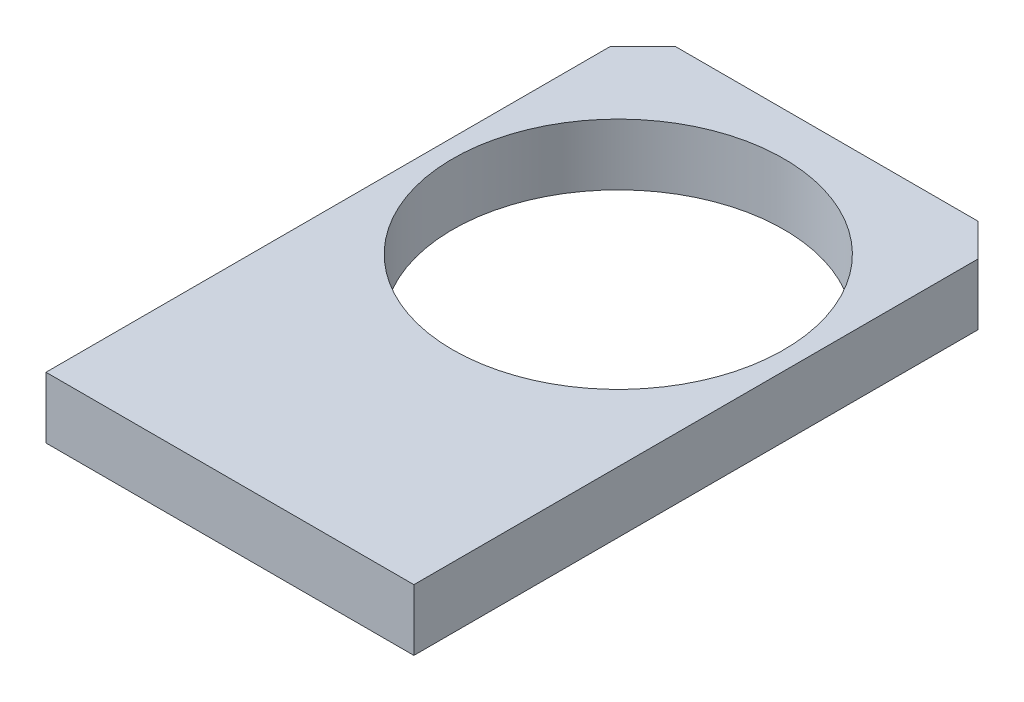
ISO-10303-21;
HEADER;
FILE_DESCRIPTION(('STEP AP214'),'2;1');
FILE_NAME('part.step','',(''),(''),'','','');
FILE_SCHEMA(('AUTOMOTIVE_DESIGN { 1 0 10303 214 1 1 1 1 }'));
ENDSEC;
DATA;
#1=APPLICATION_CONTEXT('core data for automotive mechanical design processes');
#2=APPLICATION_PROTOCOL_DEFINITION('international standard','automotive_design',2000,#1);
#3=PRODUCT_CONTEXT('',#1,'mechanical');
#4=PRODUCT('Part','Part','',(#3));
#5=PRODUCT_RELATED_PRODUCT_CATEGORY('part','',(#4));
#6=PRODUCT_DEFINITION_FORMATION('','',#4);
#7=PRODUCT_DEFINITION_CONTEXT('part definition',#1,'design');
#8=PRODUCT_DEFINITION('design','',#6,#7);
#9=PRODUCT_DEFINITION_SHAPE('','',#8);
#10=(LENGTH_UNIT() NAMED_UNIT(*) SI_UNIT(.MILLI.,.METRE.));
#11=(NAMED_UNIT(*) PLANE_ANGLE_UNIT() SI_UNIT($,.RADIAN.));
#12=(NAMED_UNIT(*) SI_UNIT($,.STERADIAN.) SOLID_ANGLE_UNIT());
#13=UNCERTAINTY_MEASURE_WITH_UNIT(LENGTH_MEASURE(1.E-05),#10,'distance_accuracy_value','');
#14=(GEOMETRIC_REPRESENTATION_CONTEXT(3) GLOBAL_UNCERTAINTY_ASSIGNED_CONTEXT((#13)) GLOBAL_UNIT_ASSIGNED_CONTEXT((#10,
#11,#12)) REPRESENTATION_CONTEXT('',''));
#15=CARTESIAN_POINT('',(0.,0.,0.));
#16=DIRECTION('',(0.,0.,1.));
#17=DIRECTION('',(1.,0.,0.));
#18=AXIS2_PLACEMENT_3D('',#15,#16,#17);
#19=CARTESIAN_POINT('',(0.,7.5,0.));
#20=DIRECTION('',(0.,-1.,0.));
#21=DIRECTION('',(0.,0.,-1.));
#22=AXIS2_PLACEMENT_3D('',#19,#20,#21);
#23=PLANE('',#22);
#24=DIRECTION('',(-1.,0.,0.));
#25=VECTOR('',#24,1.);
#26=CARTESIAN_POINT('',(-22.5,7.5,-73.));
#27=LINE('',#26,#25);
#28=CARTESIAN_POINT('',(18.5,7.5,-73.));
#29=VERTEX_POINT('',#28);
#30=CARTESIAN_POINT('',(-18.5,7.5,-73.));
#31=VERTEX_POINT('',#30);
#32=EDGE_CURVE('E129',#29,#31,#27,.T.);
#33=ORIENTED_EDGE('',*,*,#32,.T.);
#34=DIRECTION('',(0.707106781186549,0.,-0.707106781186546));
#35=VECTOR('',#34,1.);
#36=CARTESIAN_POINT('',(-22.5,7.5,-69.));
#37=LINE('',#36,#35);
#38=CARTESIAN_POINT('',(-22.5,7.5,-69.));
#39=VERTEX_POINT('',#38);
#40=EDGE_CURVE('E50',#31,#39,#37,.F.);
#41=ORIENTED_EDGE('',*,*,#40,.T.);
#42=DIRECTION('',(0.,0.,1.));
#43=VECTOR('',#42,1.);
#44=CARTESIAN_POINT('',(-22.5,7.5,0.));
#45=LINE('',#44,#43);
#46=CARTESIAN_POINT('',(-22.5,7.5,0.));
#47=VERTEX_POINT('',#46);
#48=EDGE_CURVE('E96',#39,#47,#45,.T.);
#49=ORIENTED_EDGE('',*,*,#48,.T.);
#50=DIRECTION('',(1.,0.,0.));
#51=VECTOR('',#50,1.);
#52=CARTESIAN_POINT('',(-22.5,7.5,0.));
#53=LINE('',#52,#51);
#54=CARTESIAN_POINT('',(22.5,7.5,0.));
#55=VERTEX_POINT('',#54);
#56=EDGE_CURVE('E99',#47,#55,#53,.T.);
#57=ORIENTED_EDGE('',*,*,#56,.T.);
#58=DIRECTION('',(0.,0.,-1.));
#59=VECTOR('',#58,1.);
#60=CARTESIAN_POINT('',(22.5,7.5,0.));
#61=LINE('',#60,#59);
#62=CARTESIAN_POINT('',(22.5,7.5,-69.));
#63=VERTEX_POINT('',#62);
#64=EDGE_CURVE('E116',#55,#63,#61,.T.);
#65=ORIENTED_EDGE('',*,*,#64,.T.);
#66=DIRECTION('',(0.707106781186548,0.,0.707106781186548));
#67=VECTOR('',#66,1.);
#68=CARTESIAN_POINT('',(18.5,7.5,-73.));
#69=LINE('',#68,#67);
#70=EDGE_CURVE('E144',#63,#29,#69,.F.);
#71=ORIENTED_EDGE('',*,*,#70,.T.);
#72=EDGE_LOOP('',(#33,#41,#49,#57,#65,#71));
#73=FACE_BOUND('',#72,.T.);
#74=CARTESIAN_POINT('',(0.,7.5,-47.5));
#75=DIRECTION('',(0.,1.,0.));
#76=DIRECTION('',(0.,0.,1.));
#77=AXIS2_PLACEMENT_3D('',#74,#75,#76);
#78=CIRCLE('',#77,20.25);
#79=CARTESIAN_POINT('',(0.,7.5,-27.25));
#80=VERTEX_POINT('',#79);
#81=EDGE_CURVE('E168',#80,#80,#78,.T.);
#82=ORIENTED_EDGE('',*,*,#81,.F.);
#83=EDGE_LOOP('',(#82));
#84=FACE_BOUND('',#83,.T.);
#85=ADVANCED_FACE('F41',(#73,#84),#23,.F.);
#86=CARTESIAN_POINT('',(0.,0.,0.));
#87=DIRECTION('',(0.,-1.,0.));
#88=DIRECTION('',(0.,0.,-1.));
#89=AXIS2_PLACEMENT_3D('',#86,#87,#88);
#90=PLANE('',#89);
#91=DIRECTION('',(0.,0.,1.));
#92=VECTOR('',#91,1.);
#93=CARTESIAN_POINT('',(-22.5,0.,0.));
#94=LINE('',#93,#92);
#95=CARTESIAN_POINT('',(-22.5,0.,-69.));
#96=VERTEX_POINT('',#95);
#97=CARTESIAN_POINT('',(-22.5,0.,0.));
#98=VERTEX_POINT('',#97);
#99=EDGE_CURVE('E120',#96,#98,#94,.T.);
#100=ORIENTED_EDGE('',*,*,#99,.F.);
#101=DIRECTION('',(-0.707106781186549,0.,0.707106781186546));
#102=VECTOR('',#101,1.);
#103=CARTESIAN_POINT('',(-45.75,0.,-45.7500000000001));
#104=LINE('',#103,#102);
#105=CARTESIAN_POINT('',(-18.5,0.,-73.));
#106=VERTEX_POINT('',#105);
#107=EDGE_CURVE('E135',#96,#106,#104,.F.);
#108=ORIENTED_EDGE('',*,*,#107,.T.);
#109=DIRECTION('',(-1.,0.,0.));
#110=VECTOR('',#109,1.);
#111=CARTESIAN_POINT('',(-22.5,0.,-73.));
#112=LINE('',#111,#110);
#113=CARTESIAN_POINT('',(18.5,0.,-73.));
#114=VERTEX_POINT('',#113);
#115=EDGE_CURVE('E107',#114,#106,#112,.T.);
#116=ORIENTED_EDGE('',*,*,#115,.F.);
#117=DIRECTION('',(-0.707106781186548,0.,-0.707106781186548));
#118=VECTOR('',#117,1.);
#119=CARTESIAN_POINT('',(45.75,0.,-45.75));
#120=LINE('',#119,#118);
#121=CARTESIAN_POINT('',(22.5,0.,-69.));
#122=VERTEX_POINT('',#121);
#123=EDGE_CURVE('E127',#114,#122,#120,.F.);
#124=ORIENTED_EDGE('',*,*,#123,.T.);
#125=DIRECTION('',(0.,0.,-1.));
#126=VECTOR('',#125,1.);
#127=CARTESIAN_POINT('',(22.5,0.,0.));
#128=LINE('',#127,#126);
#129=CARTESIAN_POINT('',(22.5,0.,0.));
#130=VERTEX_POINT('',#129);
#131=EDGE_CURVE('E158',#130,#122,#128,.T.);
#132=ORIENTED_EDGE('',*,*,#131,.F.);
#133=DIRECTION('',(1.,0.,0.));
#134=VECTOR('',#133,1.);
#135=CARTESIAN_POINT('',(-22.5,0.,0.));
#136=LINE('',#135,#134);
#137=EDGE_CURVE('E161',#98,#130,#136,.T.);
#138=ORIENTED_EDGE('',*,*,#137,.F.);
#139=EDGE_LOOP('',(#100,#108,#116,#124,#132,#138));
#140=FACE_BOUND('',#139,.T.);
#141=CARTESIAN_POINT('',(0.,0.,-47.5));
#142=DIRECTION('',(0.,1.,0.));
#143=DIRECTION('',(0.,0.,1.));
#144=AXIS2_PLACEMENT_3D('',#141,#142,#143);
#145=CIRCLE('',#144,20.25);
#146=CARTESIAN_POINT('',(0.,0.,-27.25));
#147=VERTEX_POINT('',#146);
#148=EDGE_CURVE('E172',#147,#147,#145,.T.);
#149=ORIENTED_EDGE('',*,*,#148,.T.);
#150=EDGE_LOOP('',(#149));
#151=FACE_BOUND('',#150,.T.);
#152=ADVANCED_FACE('F156',(#140,#151),#90,.T.);
#153=CARTESIAN_POINT('',(-22.5,7.5,0.));
#154=DIRECTION('',(1.,0.,0.));
#155=DIRECTION('',(0.,0.,-1.));
#156=AXIS2_PLACEMENT_3D('',#153,#154,#155);
#157=PLANE('',#156);
#158=ORIENTED_EDGE('',*,*,#48,.F.);
#159=DIRECTION('',(0.,-1.,0.));
#160=VECTOR('',#159,1.);
#161=CARTESIAN_POINT('',(-22.5,7.5,-69.));
#162=LINE('',#161,#160);
#163=EDGE_CURVE('E123',#39,#96,#162,.T.);
#164=ORIENTED_EDGE('',*,*,#163,.T.);
#165=ORIENTED_EDGE('',*,*,#99,.T.);
#166=DIRECTION('',(0.,-1.,0.));
#167=VECTOR('',#166,1.);
#168=CARTESIAN_POINT('',(-22.5,7.5,0.));
#169=LINE('',#168,#167);
#170=EDGE_CURVE('E112',#47,#98,#169,.T.);
#171=ORIENTED_EDGE('',*,*,#170,.F.);
#172=EDGE_LOOP('',(#158,#164,#165,#171));
#173=FACE_BOUND('',#172,.T.);
#174=ADVANCED_FACE('F118',(#173),#157,.F.);
#175=CARTESIAN_POINT('',(-22.5,7.5,0.));
#176=DIRECTION('',(0.,0.,-1.));
#177=DIRECTION('',(-1.,0.,0.));
#178=AXIS2_PLACEMENT_3D('',#175,#176,#177);
#179=PLANE('',#178);
#180=ORIENTED_EDGE('',*,*,#137,.T.);
#181=DIRECTION('',(0.,-1.,0.));
#182=VECTOR('',#181,1.);
#183=CARTESIAN_POINT('',(22.5,7.5,0.));
#184=LINE('',#183,#182);
#185=EDGE_CURVE('E114',#55,#130,#184,.T.);
#186=ORIENTED_EDGE('',*,*,#185,.F.);
#187=ORIENTED_EDGE('',*,*,#56,.F.);
#188=ORIENTED_EDGE('',*,*,#170,.T.);
#189=EDGE_LOOP('',(#180,#186,#187,#188));
#190=FACE_BOUND('',#189,.T.);
#191=ADVANCED_FACE('F111',(#190),#179,.F.);
#192=CARTESIAN_POINT('',(22.5,7.5,0.));
#193=DIRECTION('',(-1.,0.,0.));
#194=DIRECTION('',(0.,0.,1.));
#195=AXIS2_PLACEMENT_3D('',#192,#193,#194);
#196=PLANE('',#195);
#197=ORIENTED_EDGE('',*,*,#131,.T.);
#198=DIRECTION('',(0.,1.,0.));
#199=VECTOR('',#198,1.);
#200=CARTESIAN_POINT('',(22.5,7.5,-69.));
#201=LINE('',#200,#199);
#202=EDGE_CURVE('E11',#122,#63,#201,.T.);
#203=ORIENTED_EDGE('',*,*,#202,.T.);
#204=ORIENTED_EDGE('',*,*,#64,.F.);
#205=ORIENTED_EDGE('',*,*,#185,.T.);
#206=EDGE_LOOP('',(#197,#203,#204,#205));
#207=FACE_BOUND('',#206,.T.);
#208=ADVANCED_FACE('F159',(#207),#196,.F.);
#209=CARTESIAN_POINT('',(-22.5,7.5,-73.));
#210=DIRECTION('',(0.,0.,1.));
#211=DIRECTION('',(1.,0.,0.));
#212=AXIS2_PLACEMENT_3D('',#209,#210,#211);
#213=PLANE('',#212);
#214=ORIENTED_EDGE('',*,*,#115,.T.);
#215=DIRECTION('',(0.,1.,0.));
#216=VECTOR('',#215,1.);
#217=CARTESIAN_POINT('',(-18.5,7.5,-73.));
#218=LINE('',#217,#216);
#219=EDGE_CURVE('E63',#106,#31,#218,.T.);
#220=ORIENTED_EDGE('',*,*,#219,.T.);
#221=ORIENTED_EDGE('',*,*,#32,.F.);
#222=DIRECTION('',(0.,-1.,0.));
#223=VECTOR('',#222,1.);
#224=CARTESIAN_POINT('',(18.5,7.5,-73.));
#225=LINE('',#224,#223);
#226=EDGE_CURVE('E138',#29,#114,#225,.T.);
#227=ORIENTED_EDGE('',*,*,#226,.T.);
#228=EDGE_LOOP('',(#214,#220,#221,#227));
#229=FACE_BOUND('',#228,.T.);
#230=ADVANCED_FACE('F150',(#229),#213,.F.);
#231=CARTESIAN_POINT('',(0.,7.5,-47.5));
#232=DIRECTION('',(0.,-1.,0.));
#233=DIRECTION('',(0.,0.,-1.));
#234=AXIS2_PLACEMENT_3D('',#231,#232,#233);
#235=CYLINDRICAL_SURFACE('',#234,20.25);
#236=ORIENTED_EDGE('',*,*,#81,.T.);
#237=EDGE_LOOP('',(#236));
#238=FACE_BOUND('',#237,.T.);
#239=ORIENTED_EDGE('',*,*,#148,.F.);
#240=EDGE_LOOP('',(#239));
#241=FACE_BOUND('',#240,.T.);
#242=ADVANCED_FACE('F180',(#238,#241),#235,.F.);
#243=CARTESIAN_POINT('',(-22.5,7.5,-69.));
#244=DIRECTION('',(0.707106781186546,0.,0.707106781186549));
#245=DIRECTION('',(0.,-1.,0.));
#246=AXIS2_PLACEMENT_3D('',#243,#244,#245);
#247=PLANE('',#246);
#248=ORIENTED_EDGE('',*,*,#40,.F.);
#249=ORIENTED_EDGE('',*,*,#219,.F.);
#250=ORIENTED_EDGE('',*,*,#107,.F.);
#251=ORIENTED_EDGE('',*,*,#163,.F.);
#252=EDGE_LOOP('',(#248,#249,#250,#251));
#253=FACE_BOUND('',#252,.T.);
#254=ADVANCED_FACE('F197',(#253),#247,.F.);
#255=CARTESIAN_POINT('',(18.5,7.5,-73.));
#256=DIRECTION('',(-0.707106781186548,0.,0.707106781186548));
#257=DIRECTION('',(0.,-1.,0.));
#258=AXIS2_PLACEMENT_3D('',#255,#256,#257);
#259=PLANE('',#258);
#260=ORIENTED_EDGE('',*,*,#70,.F.);
#261=ORIENTED_EDGE('',*,*,#202,.F.);
#262=ORIENTED_EDGE('',*,*,#123,.F.);
#263=ORIENTED_EDGE('',*,*,#226,.F.);
#264=EDGE_LOOP('',(#260,#261,#262,#263));
#265=FACE_BOUND('',#264,.T.);
#266=ADVANCED_FACE('F43',(#265),#259,.F.);
#267=CLOSED_SHELL('',(#85,#152,#174,#191,#208,#230,#242,#254,#266));
#268=MANIFOLD_SOLID_BREP('B2',#267);
#269=ADVANCED_BREP_SHAPE_REPRESENTATION('',(#18,#268),#14);
#270=SHAPE_DEFINITION_REPRESENTATION(#9,#269);
ENDSEC;
END-ISO-10303-21;
